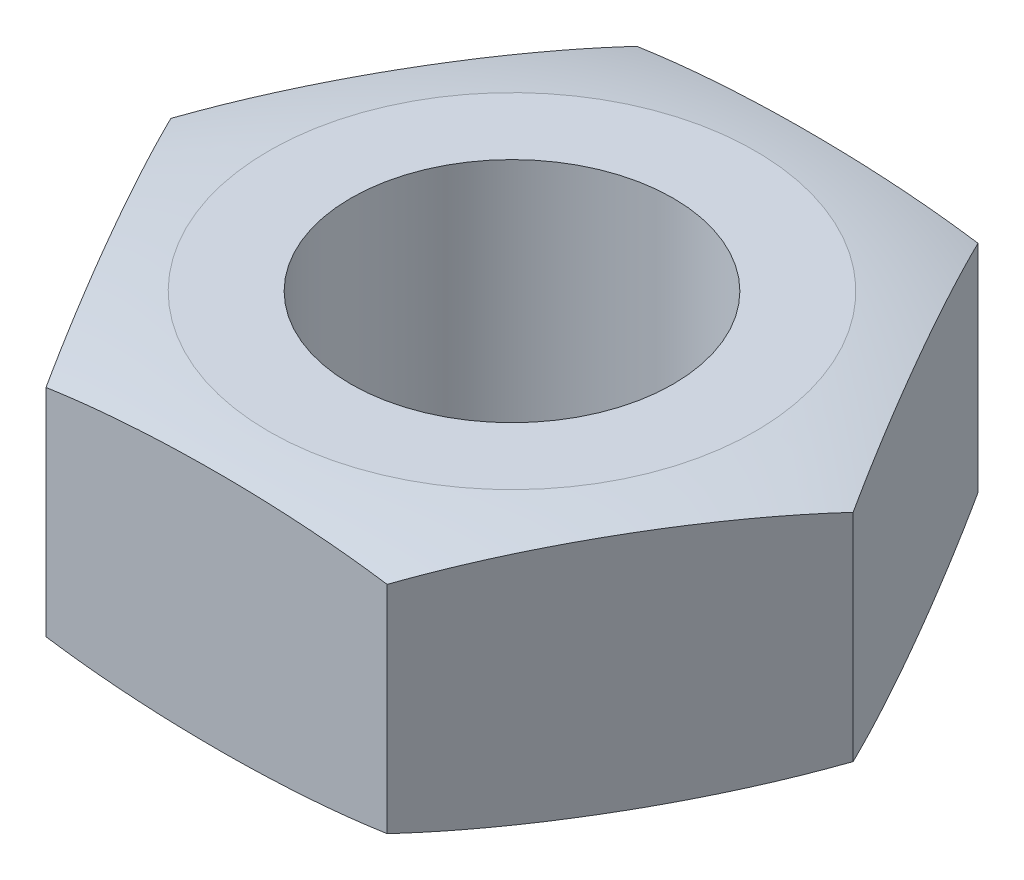
ISO-10303-21;
HEADER;
FILE_DESCRIPTION(('STEP AP214'),'2;1');
FILE_NAME('part.step','',(''),(''),'','','');
FILE_SCHEMA(('AUTOMOTIVE_DESIGN { 1 0 10303 214 1 1 1 1 }'));
ENDSEC;
DATA;
#1=APPLICATION_CONTEXT('core data for automotive mechanical design processes');
#2=APPLICATION_PROTOCOL_DEFINITION('international standard','automotive_design',2000,#1);
#3=PRODUCT_CONTEXT('',#1,'mechanical');
#4=PRODUCT('Part','Part','',(#3));
#5=PRODUCT_RELATED_PRODUCT_CATEGORY('part','',(#4));
#6=PRODUCT_DEFINITION_FORMATION('','',#4);
#7=PRODUCT_DEFINITION_CONTEXT('part definition',#1,'design');
#8=PRODUCT_DEFINITION('design','',#6,#7);
#9=PRODUCT_DEFINITION_SHAPE('','',#8);
#10=(LENGTH_UNIT() NAMED_UNIT(*) SI_UNIT(.MILLI.,.METRE.));
#11=(NAMED_UNIT(*) PLANE_ANGLE_UNIT() SI_UNIT($,.RADIAN.));
#12=(NAMED_UNIT(*) SI_UNIT($,.STERADIAN.) SOLID_ANGLE_UNIT());
#13=UNCERTAINTY_MEASURE_WITH_UNIT(LENGTH_MEASURE(1.E-05),#10,'distance_accuracy_value','');
#14=(GEOMETRIC_REPRESENTATION_CONTEXT(3) GLOBAL_UNCERTAINTY_ASSIGNED_CONTEXT((#13)) GLOBAL_UNIT_ASSIGNED_CONTEXT((#10,
#11,#12)) REPRESENTATION_CONTEXT('',''));
#15=CARTESIAN_POINT('',(0.,0.,0.));
#16=DIRECTION('',(0.,0.,1.));
#17=DIRECTION('',(1.,0.,0.));
#18=AXIS2_PLACEMENT_3D('',#15,#16,#17);
#19=CARTESIAN_POINT('',(0.,2.4,0.));
#20=DIRECTION('',(0.,1.,0.));
#21=DIRECTION('',(0.,0.,1.));
#22=AXIS2_PLACEMENT_3D('',#19,#20,#21);
#23=PLANE('',#22);
#24=CARTESIAN_POINT('',(0.,2.4,0.));
#25=DIRECTION('',(0.,1.,0.));
#26=DIRECTION('',(0.,0.,1.));
#27=AXIS2_PLACEMENT_3D('',#24,#25,#26);
#28=CIRCLE('',#27,1.5);
#29=CARTESIAN_POINT('',(0.,2.4,1.5));
#30=VERTEX_POINT('',#29);
#31=EDGE_CURVE('E113',#30,#30,#28,.T.);
#32=ORIENTED_EDGE('',*,*,#31,.F.);
#33=EDGE_LOOP('',(#32));
#34=FACE_BOUND('',#33,.T.);
#35=CARTESIAN_POINT('',(0.,2.4,0.));
#36=DIRECTION('',(0.,1.,0.));
#37=DIRECTION('',(0.,0.,1.));
#38=AXIS2_PLACEMENT_3D('',#35,#36,#37);
#39=CIRCLE('',#38,2.26306020734449);
#40=CARTESIAN_POINT('',(0.,2.4,2.26306020734449));
#41=VERTEX_POINT('',#40);
#42=EDGE_CURVE('E201',#41,#41,#39,.F.);
#43=ORIENTED_EDGE('',*,*,#42,.F.);
#44=EDGE_LOOP('',(#43));
#45=FACE_BOUND('',#44,.T.);
#46=ADVANCED_FACE('F33',(#34,#45),#23,.T.);
#47=CARTESIAN_POINT('',(0.,0.,0.));
#48=DIRECTION('',(0.,1.,0.));
#49=DIRECTION('',(0.,0.,1.));
#50=AXIS2_PLACEMENT_3D('',#47,#48,#49);
#51=PLANE('',#50);
#52=CARTESIAN_POINT('',(0.,0.,0.));
#53=DIRECTION('',(0.,1.,0.));
#54=DIRECTION('',(0.,0.,1.));
#55=AXIS2_PLACEMENT_3D('',#52,#53,#54);
#56=CIRCLE('',#55,1.5);
#57=CARTESIAN_POINT('',(0.,0.,1.5));
#58=VERTEX_POINT('',#57);
#59=EDGE_CURVE('E204',#58,#58,#56,.T.);
#60=ORIENTED_EDGE('',*,*,#59,.T.);
#61=EDGE_LOOP('',(#60));
#62=FACE_BOUND('',#61,.T.);
#63=CARTESIAN_POINT('',(0.,0.,0.));
#64=DIRECTION('',(0.,1.,0.));
#65=DIRECTION('',(0.,0.,1.));
#66=AXIS2_PLACEMENT_3D('',#63,#64,#65);
#67=CIRCLE('',#66,2.2630602073445);
#68=CARTESIAN_POINT('',(0.,0.,2.2630602073445));
#69=VERTEX_POINT('',#68);
#70=EDGE_CURVE('E236',#69,#69,#67,.T.);
#71=ORIENTED_EDGE('',*,*,#70,.F.);
#72=EDGE_LOOP('',(#71));
#73=FACE_BOUND('',#72,.T.);
#74=ADVANCED_FACE('F209',(#62,#73),#51,.F.);
#75=CARTESIAN_POINT('',(0.,2.4,0.));
#76=DIRECTION('',(0.,-1.,0.));
#77=DIRECTION('',(0.,0.,-1.));
#78=AXIS2_PLACEMENT_3D('',#75,#76,#77);
#79=CYLINDRICAL_SURFACE('',#78,1.5);
#80=ORIENTED_EDGE('',*,*,#31,.T.);
#81=EDGE_LOOP('',(#80));
#82=FACE_BOUND('',#81,.T.);
#83=ORIENTED_EDGE('',*,*,#59,.F.);
#84=EDGE_LOOP('',(#83));
#85=FACE_BOUND('',#84,.T.);
#86=ADVANCED_FACE('F135',(#82,#85),#79,.F.);
#87=CARTESIAN_POINT('',(0.,5.79760880032627,0.));
#88=DIRECTION('',(0.,-1.,0.));
#89=DIRECTION('',(0.,0.,-1.));
#90=AXIS2_PLACEMENT_3D('',#87,#88,#89);
#91=DEGENERATE_TOROIDAL_SURFACE('',#90,1.5,5.84760880032627,.T.);
#92=CARTESIAN_POINT('',(3.17554195059678,0.195190765911309,-0.000199999999999884));
#93=CARTESIAN_POINT('',(3.10970637660242,0.175507404125676,0.113830559103688));
#94=CARTESIAN_POINT('',(3.04365990153023,0.15884806046564,0.228226409589562));
#95=CARTESIAN_POINT('',(2.91130605269814,0.130963797625645,0.45747000034403));
#96=CARTESIAN_POINT('',(2.8449987974945,0.119736644783678,0.572317535267184));
#97=CARTESIAN_POINT('',(2.71254384273543,0.102129704822879,0.801736246624119));
#98=CARTESIAN_POINT('',(2.6463968716881,0.0957272436795646,0.916306161244891));
#99=CARTESIAN_POINT('',(2.51402322857986,0.0872438740575399,1.14558403669136));
#100=CARTESIAN_POINT('',(2.44779654449354,0.0851637299760271,1.26029201834568));
#101=CARTESIAN_POINT('',(2.31534317632091,0.0851637299760267,1.48970798165431));
#102=CARTESIAN_POINT('',(2.24911649223459,0.087243874057539,1.60441596330862));
#103=CARTESIAN_POINT('',(2.11674284912635,0.0957272436795638,1.83369383875509));
#104=CARTESIAN_POINT('',(2.05059587807901,0.102129704822878,1.94826375337586));
#105=CARTESIAN_POINT('',(1.91814092331995,0.119736644783678,2.1776824647328));
#106=CARTESIAN_POINT('',(1.8518336681163,0.130963797625645,2.29252999965595));
#107=CARTESIAN_POINT('',(1.71947981928422,0.15884806046564,2.52177359041042));
#108=CARTESIAN_POINT('',(1.65343334421202,0.175507404125675,2.63616944089629));
#109=CARTESIAN_POINT('',(1.58759777021767,0.195190765911309,2.75019999999998));
#110=B_SPLINE_CURVE_WITH_KNOTS('',3,(#92,#93,#94,#95,#96,#97,#98,#99,#100,#101,#102,#103,#104,
#105,#106,#107,#108,#109),.UNSPECIFIED.,.F.,.F.,(4,2,2,2,2,2,2,2,4),(0.,0.399324257481253,
0.798484177023077,1.19575630852369,1.59309869120282,1.99044107388195,2.38771320538256,
2.78687312492438,3.18619738240563),.UNSPECIFIED.);
#111=CARTESIAN_POINT('',(3.17542648054294,0.195156231142955,0.));
#112=VERTEX_POINT('',#111);
#113=CARTESIAN_POINT('',(1.5877132402715,0.195156231142954,2.74999999999998));
#114=VERTEX_POINT('',#113);
#115=EDGE_CURVE('E62',#112,#114,#110,.T.);
#116=ORIENTED_EDGE('',*,*,#115,.T.);
#117=CARTESIAN_POINT('',(4.77773028105844,1.54399340725614,2.74999999999995));
#118=CARTESIAN_POINT('',(4.64713600113223,1.43717665174646,2.74999999999995));
#119=CARTESIAN_POINT('',(4.51180855767463,1.3362058234138,2.74999999999995));
#120=CARTESIAN_POINT('',(4.23304689911178,1.14640695599499,2.74999999999995));
#121=CARTESIAN_POINT('',(4.0896194319695,1.05756901417398,2.74999999999996));
#122=CARTESIAN_POINT('',(3.79824313973091,0.893685076370557,2.74999999999996));
#123=CARTESIAN_POINT('',(3.65040925299496,0.818434193080734,2.74999999999996));
#124=CARTESIAN_POINT('',(3.34918302325373,0.679982896567805,2.74999999999996));
#125=CARTESIAN_POINT('',(3.195789339152,0.61678541411599,2.74999999999997));
#126=CARTESIAN_POINT('',(2.83622031111343,0.484460915433417,2.74999999999997));
#127=CARTESIAN_POINT('',(2.6284675425263,0.4196033409182,2.74999999999997));
#128=CARTESIAN_POINT('',(2.20794504812949,0.309097272031445,2.74999999999998));
#129=CARTESIAN_POINT('',(1.99517395472464,0.263454079363231,2.74999999999998));
#130=CARTESIAN_POINT('',(1.56500325529593,0.188896022187078,2.74999999999998));
#131=CARTESIAN_POINT('',(1.34758003135557,0.160120953780981,2.74999999999999));
#132=CARTESIAN_POINT('',(0.911332395632242,0.116956165648469,2.74999999999999));
#133=CARTESIAN_POINT('',(0.692507767802179,0.102568720467057,2.74999999999999));
#134=CARTESIAN_POINT('',(0.357453480795598,0.0897182304368472,2.75));
#135=CARTESIAN_POINT('',(0.241362795029605,0.0869484334347612,2.75));
#136=CARTESIAN_POINT('',(0.00914483388629153,0.0846282233381106,2.75));
#137=CARTESIAN_POINT('',(-0.106982441676806,0.0850778268615775,2.75));
#138=CARTESIAN_POINT('',(-0.33919172652221,0.0892181966378628,2.75));
#139=CARTESIAN_POINT('',(-0.455273730576654,0.0929092649793906,2.75));
#140=CARTESIAN_POINT('',(-0.687273676824347,0.103745972295698,2.75000000000001));
#141=CARTESIAN_POINT('',(-0.803191617440845,0.110891644248264,2.75000000000001));
#142=CARTESIAN_POINT('',(-1.14960598378012,0.137951316529396,2.75000000000001));
#143=CARTESIAN_POINT('',(-1.37970781732447,0.163499873610182,2.75000000000001));
#144=CARTESIAN_POINT('',(-1.837070239563,0.233046815279585,2.75000000000002));
#145=CARTESIAN_POINT('',(-2.06433245690889,0.277034072193646,2.75000000000002));
#146=CARTESIAN_POINT('',(-2.45989983220848,0.373231309052319,2.75000000000003));
#147=CARTESIAN_POINT('',(-2.62929467119488,0.42095192889325,2.75000000000003));
#148=CARTESIAN_POINT('',(-2.96381500587482,0.529502867779865,2.75000000000003));
#149=CARTESIAN_POINT('',(-3.12894165183637,0.59032961261675,2.75000000000003));
#150=CARTESIAN_POINT('',(-3.45329966799621,0.725391333504965,2.75000000000004));
#151=CARTESIAN_POINT('',(-3.61254067949747,0.799603093164125,2.75000000000004));
#152=CARTESIAN_POINT('',(-3.92393692934538,0.961516191335974,2.75000000000004));
#153=CARTESIAN_POINT('',(-4.07609608011628,1.04920996355412,2.75000000000004));
#154=CARTESIAN_POINT('',(-4.32012087928572,1.20477091294482,2.75000000000004));
#155=CARTESIAN_POINT('',(-4.41443732278513,1.26882373352528,2.75000000000005));
#156=CARTESIAN_POINT('',(-4.59912718570446,1.402364552311,2.75000000000005));
#157=CARTESIAN_POINT('',(-4.68950093743444,1.47185209106658,2.75000000000005));
#158=CARTESIAN_POINT('',(-4.77773028105838,1.54399340725614,2.75000000000005));
#159=B_SPLINE_CURVE_WITH_KNOTS('',3,(#117,#118,#119,#120,#121,#122,#123,#124,#125,#126,#127,
#128,#129,#130,#131,#132,#133,#134,#135,#136,#137,#138,#139,#140,#141,#142,#143,#144,#145,#146,
#147,#148,#149,#150,#151,#152,#153,#154,#155,#156,#157,#158),.UNSPECIFIED.,.F.,.F.,(4,2,2,2,2,2,
2,2,2,2,2,2,2,2,2,2,2,2,2,2,4),(0.,0.505924497310359,1.01143356456988,1.50853153800901,
2.00575022661724,2.6576188675461,3.30966725677581,3.96704583023985,4.62452831251903,
4.97286495544437,5.32120339642914,5.66957430430292,6.01794853780518,6.71186706992845,
7.40536742680102,7.93284790221685,8.4601847085846,8.98661549148125,9.51275190531162,
9.8545991443603,10.1964175149048),.UNSPECIFIED.);
#160=CARTESIAN_POINT('',(-1.58771324026132,0.19515623114144,2.75000000000002));
#161=VERTEX_POINT('',#160);
#162=EDGE_CURVE('E48',#114,#161,#159,.T.);
#163=ORIENTED_EDGE('',*,*,#162,.T.);
#164=CARTESIAN_POINT('',(-1.58759777021761,0.19519076591131,2.75020000000002));
#165=CARTESIAN_POINT('',(-1.65343334421197,0.175507404125676,2.63616944089633));
#166=CARTESIAN_POINT('',(-1.71947981928416,0.15884806046564,2.52177359041045));
#167=CARTESIAN_POINT('',(-1.85183366811626,0.130963797625643,2.29252999965598));
#168=CARTESIAN_POINT('',(-1.9181409233199,0.119736644783676,2.17768246473283));
#169=CARTESIAN_POINT('',(-2.05059587807897,0.102129704822876,1.94826375337589));
#170=CARTESIAN_POINT('',(-2.11674284912631,0.0957272436795614,1.83369383875512));
#171=CARTESIAN_POINT('',(-2.24911649223455,0.0872438740575367,1.60441596330865));
#172=CARTESIAN_POINT('',(-2.31534317632087,0.0851637299760244,1.48970798165434));
#173=CARTESIAN_POINT('',(-2.44779654449351,0.0851637299760249,1.2602920183457));
#174=CARTESIAN_POINT('',(-2.51402322857983,0.0872438740575376,1.14558403669139));
#175=CARTESIAN_POINT('',(-2.64639687168808,0.0957272436795621,0.916306161244917));
#176=CARTESIAN_POINT('',(-2.71254384273542,0.102129704822876,0.801736246624144));
#177=CARTESIAN_POINT('',(-2.84499879749448,0.119736644783676,0.572317535267209));
#178=CARTESIAN_POINT('',(-2.91130605269813,0.130963797625642,0.457470000344055));
#179=CARTESIAN_POINT('',(-3.04365990153023,0.158848060465639,0.228226409589585));
#180=CARTESIAN_POINT('',(-3.10970637660242,0.175507404125675,0.113830559103711));
#181=CARTESIAN_POINT('',(-3.17554195059678,0.195190765911309,-0.000199999999977638));
#182=B_SPLINE_CURVE_WITH_KNOTS('',3,(#164,#165,#166,#167,#168,#169,#170,#171,#172,#173,#174,
#175,#176,#177,#178,#179,#180,#181),.UNSPECIFIED.,.F.,.F.,(4,2,2,2,2,2,2,2,4),(0.,
0.399324257481259,0.798484177023086,1.1957563085237,1.59309869120284,1.99044107388197,
2.38771320538259,2.78687312492441,3.18619738240567),.UNSPECIFIED.);
#183=CARTESIAN_POINT('',(-3.17542648054294,0.195156231142955,0.));
#184=VERTEX_POINT('',#183);
#185=EDGE_CURVE('E92',#161,#184,#182,.T.);
#186=ORIENTED_EDGE('',*,*,#185,.T.);
#187=CARTESIAN_POINT('',(-3.17554195059678,0.19519076591131,0.000200000000022174));
#188=CARTESIAN_POINT('',(-3.10970637660242,0.175507404125676,-0.113830559103667));
#189=CARTESIAN_POINT('',(-3.04365990153023,0.15884806046564,-0.228226409589542));
#190=CARTESIAN_POINT('',(-2.91130605269814,0.130963797625643,-0.457470000344013));
#191=CARTESIAN_POINT('',(-2.84499879749449,0.119736644783676,-0.572317535267168));
#192=CARTESIAN_POINT('',(-2.71254384273543,0.102129704822876,-0.801736246624106));
#193=CARTESIAN_POINT('',(-2.64639687168809,0.0957272436795622,-0.91630616124488));
#194=CARTESIAN_POINT('',(-2.51402322857985,0.0872438740575376,-1.14558403669135));
#195=CARTESIAN_POINT('',(-2.44779654449353,0.0851637299760245,-1.26029201834567));
#196=CARTESIAN_POINT('',(-2.3153431763209,0.0851637299760245,-1.4897079816543));
#197=CARTESIAN_POINT('',(-2.24911649223458,0.0872438740575375,-1.60441596330862));
#198=CARTESIAN_POINT('',(-2.11674284912633,0.0957272436795621,-1.83369383875509));
#199=CARTESIAN_POINT('',(-2.050595878079,0.102129704822876,-1.94826375337587));
#200=CARTESIAN_POINT('',(-1.91814092331994,0.119736644783676,-2.1776824647328));
#201=CARTESIAN_POINT('',(-1.85183366811629,0.130963797625643,-2.29252999965596));
#202=CARTESIAN_POINT('',(-1.7194798192842,0.15884806046564,-2.52177359041043));
#203=CARTESIAN_POINT('',(-1.653433344212,0.175507404125676,-2.6361694408963));
#204=CARTESIAN_POINT('',(-1.58759777021765,0.195190765911309,-2.75019999999999));
#205=B_SPLINE_CURVE_WITH_KNOTS('',3,(#187,#188,#189,#190,#191,#192,#193,#194,#195,#196,#197,
#198,#199,#200,#201,#202,#203,#204),.UNSPECIFIED.,.F.,.F.,(4,2,2,2,2,2,2,2,4),(0.,
0.399324257481258,0.798484177023086,1.1957563085237,1.59309869120284,1.99044107388197,
2.38771320538258,2.78687312492441,3.18619738240567),.UNSPECIFIED.);
#206=CARTESIAN_POINT('',(-1.58771324027148,0.195156231142956,-2.74999999999999));
#207=VERTEX_POINT('',#206);
#208=EDGE_CURVE('E106',#184,#207,#205,.T.);
#209=ORIENTED_EDGE('',*,*,#208,.T.);
#210=CARTESIAN_POINT('',(-4.77773028105842,1.54399340725614,-2.74999999999998));
#211=CARTESIAN_POINT('',(-4.64713600113221,1.43717665174646,-2.74999999999998));
#212=CARTESIAN_POINT('',(-4.51180855767461,1.3362058234138,-2.74999999999998));
#213=CARTESIAN_POINT('',(-4.23304689911176,1.14640695599499,-2.74999999999998));
#214=CARTESIAN_POINT('',(-4.08961943196948,1.05756901417398,-2.74999999999998));
#215=CARTESIAN_POINT('',(-3.79824313973089,0.893685076370556,-2.74999999999999));
#216=CARTESIAN_POINT('',(-3.65040925299494,0.818434193080734,-2.74999999999999));
#217=CARTESIAN_POINT('',(-3.34918302325371,0.679982896567805,-2.74999999999999));
#218=CARTESIAN_POINT('',(-3.19578933915198,0.61678541411599,-2.74999999999999));
#219=CARTESIAN_POINT('',(-2.83622031111341,0.484460915433416,-2.74999999999999));
#220=CARTESIAN_POINT('',(-2.62846754252628,0.4196033409182,-2.74999999999999));
#221=CARTESIAN_POINT('',(-2.20794504812947,0.309097272031444,-2.74999999999999));
#222=CARTESIAN_POINT('',(-1.99517395472462,0.263454079363229,-2.74999999999999));
#223=CARTESIAN_POINT('',(-1.56500325529591,0.188896022187077,-2.74999999999999));
#224=CARTESIAN_POINT('',(-1.34758003135555,0.160120953780981,-2.74999999999999));
#225=CARTESIAN_POINT('',(-0.911332395632221,0.116956165648469,-2.75));
#226=CARTESIAN_POINT('',(-0.692507767802157,0.102568720467057,-2.75));
#227=CARTESIAN_POINT('',(-0.357453480795576,0.0897182304368472,-2.75));
#228=CARTESIAN_POINT('',(-0.241362795029583,0.0869484334347614,-2.75));
#229=CARTESIAN_POINT('',(-0.00914483388626991,0.0846282233381106,-2.75));
#230=CARTESIAN_POINT('',(0.106982441676828,0.0850778268615772,-2.75));
#231=CARTESIAN_POINT('',(0.339191726522232,0.0892181966378628,-2.75));
#232=CARTESIAN_POINT('',(0.455273730576676,0.0929092649793913,-2.75));
#233=CARTESIAN_POINT('',(0.687273676824369,0.103745972295699,-2.75));
#234=CARTESIAN_POINT('',(0.803191617440866,0.110891644248264,-2.75));
#235=CARTESIAN_POINT('',(1.14960598378014,0.137951316529395,-2.75));
#236=CARTESIAN_POINT('',(1.37970781732449,0.163499873610183,-2.75));
#237=CARTESIAN_POINT('',(1.83707023956302,0.233046815279586,-2.75000000000001));
#238=CARTESIAN_POINT('',(2.06433245690891,0.277034072193648,-2.75000000000001));
#239=CARTESIAN_POINT('',(2.4598998322085,0.373231309052319,-2.75000000000001));
#240=CARTESIAN_POINT('',(2.6292946711949,0.42095192889325,-2.75000000000001));
#241=CARTESIAN_POINT('',(2.96381500587484,0.529502867779866,-2.75000000000001));
#242=CARTESIAN_POINT('',(3.12894165183639,0.590329612616751,-2.75000000000001));
#243=CARTESIAN_POINT('',(3.45329966799623,0.725391333504967,-2.75000000000001));
#244=CARTESIAN_POINT('',(3.61254067949749,0.799603093164126,-2.75000000000001));
#245=CARTESIAN_POINT('',(3.92393692934541,0.961516191335975,-2.75000000000001));
#246=CARTESIAN_POINT('',(4.07609608011631,1.04920996355412,-2.75000000000001));
#247=CARTESIAN_POINT('',(4.32012087928574,1.20477091294482,-2.75000000000002));
#248=CARTESIAN_POINT('',(4.41443732278515,1.26882373352528,-2.75000000000002));
#249=CARTESIAN_POINT('',(4.59912718570448,1.402364552311,-2.75000000000002));
#250=CARTESIAN_POINT('',(4.68950093743446,1.47185209106658,-2.75000000000002));
#251=CARTESIAN_POINT('',(4.7777302810584,1.54399340725614,-2.75000000000002));
#252=B_SPLINE_CURVE_WITH_KNOTS('',3,(#210,#211,#212,#213,#214,#215,#216,#217,#218,#219,#220,
#221,#222,#223,#224,#225,#226,#227,#228,#229,#230,#231,#232,#233,#234,#235,#236,#237,#238,#239,
#240,#241,#242,#243,#244,#245,#246,#247,#248,#249,#250,#251),.UNSPECIFIED.,.F.,.F.,(4,2,2,2,2,2,
2,2,2,2,2,2,2,2,2,2,2,2,2,2,4),(0.,0.505924497310359,1.01143356456988,1.50853153800901,
2.00575022661724,2.6576188675461,3.30966725677581,3.96704583023985,4.62452831251903,
4.97286495544437,5.32120339642914,5.66957430430292,6.01794853780518,6.71186706992845,
7.40536742680102,7.93284790221684,8.4601847085846,8.98661549148125,9.51275190531162,
9.8545991443603,10.1964175149048),.UNSPECIFIED.);
#253=CARTESIAN_POINT('',(1.58771324026134,0.195156231141441,-2.75000000000001));
#254=VERTEX_POINT('',#253);
#255=EDGE_CURVE('E155',#207,#254,#252,.T.);
#256=ORIENTED_EDGE('',*,*,#255,.T.);
#257=CARTESIAN_POINT('',(1.58759777021763,0.19519076591131,-2.75020000000001));
#258=CARTESIAN_POINT('',(1.65343334421199,0.175507404125676,-2.63616944089632));
#259=CARTESIAN_POINT('',(1.71947981928418,0.15884806046564,-2.52177359041044));
#260=CARTESIAN_POINT('',(1.85183366811627,0.130963797625643,-2.29252999965597));
#261=CARTESIAN_POINT('',(1.91814092331992,0.119736644783676,-2.17768246473282));
#262=CARTESIAN_POINT('',(2.05059587807899,0.102129704822876,-1.94826375337588));
#263=CARTESIAN_POINT('',(2.11674284912632,0.0957272436795619,-1.83369383875511));
#264=CARTESIAN_POINT('',(2.24911649223457,0.0872438740575368,-1.60441596330864));
#265=CARTESIAN_POINT('',(2.31534317632089,0.0851637299760237,-1.48970798165432));
#266=CARTESIAN_POINT('',(2.44779654449352,0.0851637299760237,-1.26029201834569));
#267=CARTESIAN_POINT('',(2.51402322857984,0.0872438740575368,-1.14558403669137));
#268=CARTESIAN_POINT('',(2.64639687168809,0.095727243679562,-0.916306161244899));
#269=CARTESIAN_POINT('',(2.71254384273542,0.102129704822876,-0.801736246624125));
#270=CARTESIAN_POINT('',(2.84499879749449,0.119736644783676,-0.572317535267188));
#271=CARTESIAN_POINT('',(2.91130605269814,0.130963797625643,-0.457470000344034));
#272=CARTESIAN_POINT('',(3.04365990153023,0.15884806046564,-0.228226409589563));
#273=CARTESIAN_POINT('',(3.10970637660242,0.175507404125676,-0.113830559103689));
#274=CARTESIAN_POINT('',(3.17554195059678,0.19519076591131,0.000200000000000036));
#275=B_SPLINE_CURVE_WITH_KNOTS('',3,(#257,#258,#259,#260,#261,#262,#263,#264,#265,#266,#267,
#268,#269,#270,#271,#272,#273,#274),.UNSPECIFIED.,.F.,.F.,(4,2,2,2,2,2,2,2,4),(0.,
0.399324257481259,0.798484177023087,1.1957563085237,1.59309869120284,1.99044107388197,
2.38771320538259,2.78687312492441,3.18619738240567),.UNSPECIFIED.);
#276=EDGE_CURVE('E162',#254,#112,#275,.T.);
#277=ORIENTED_EDGE('',*,*,#276,.T.);
#278=EDGE_LOOP('',(#116,#163,#186,#209,#256,#277));
#279=FACE_BOUND('',#278,.T.);
#280=ORIENTED_EDGE('',*,*,#70,.T.);
#281=EDGE_LOOP('',(#280));
#282=FACE_BOUND('',#281,.T.);
#283=ADVANCED_FACE('F90',(#279,#282),#91,.T.);
#284=CARTESIAN_POINT('',(0.,-3.39760880032616,0.));
#285=DIRECTION('',(0.,-1.,0.));
#286=DIRECTION('',(0.,0.,-1.));
#287=AXIS2_PLACEMENT_3D('',#284,#285,#286);
#288=DEGENERATE_TOROIDAL_SURFACE('',#287,1.5,5.84760880032616,.T.);
#289=ORIENTED_EDGE('',*,*,#42,.T.);
#290=EDGE_LOOP('',(#289));
#291=FACE_BOUND('',#290,.T.);
#292=CARTESIAN_POINT('',(1.58759777021763,2.20480923408869,-2.75020000000001));
#293=CARTESIAN_POINT('',(1.65343334421199,2.22449259587432,-2.63616944089632));
#294=CARTESIAN_POINT('',(1.71947981928418,2.24115193953436,-2.52177359041044));
#295=CARTESIAN_POINT('',(1.85183366811627,2.26903620237435,-2.29252999965597));
#296=CARTESIAN_POINT('',(1.91814092331992,2.28026335521632,-2.17768246473282));
#297=CARTESIAN_POINT('',(2.05059587807899,2.29787029517712,-1.94826375337588));
#298=CARTESIAN_POINT('',(2.11674284912632,2.30427275632043,-1.83369383875511));
#299=CARTESIAN_POINT('',(2.24911649223457,2.31275612594246,-1.60441596330864));
#300=CARTESIAN_POINT('',(2.31534317632089,2.31483627002397,-1.48970798165432));
#301=CARTESIAN_POINT('',(2.44779654449352,2.31483627002397,-1.26029201834568));
#302=CARTESIAN_POINT('',(2.51402322857984,2.31275612594246,-1.14558403669137));
#303=CARTESIAN_POINT('',(2.64639687168809,2.30427275632043,-0.916306161244898));
#304=CARTESIAN_POINT('',(2.71254384273542,2.29787029517712,-0.801736246624124));
#305=CARTESIAN_POINT('',(2.84499879749449,2.28026335521632,-0.572317535267187));
#306=CARTESIAN_POINT('',(2.91130605269814,2.26903620237435,-0.457470000344033));
#307=CARTESIAN_POINT('',(3.04365990153023,2.24115193953436,-0.228226409589563));
#308=CARTESIAN_POINT('',(3.10970637660242,2.22449259587432,-0.113830559103689));
#309=CARTESIAN_POINT('',(3.17554195059678,2.20480923408868,0.000200000000000693));
#310=B_SPLINE_CURVE_WITH_KNOTS('',3,(#292,#293,#294,#295,#296,#297,#298,#299,#300,#301,#302,
#303,#304,#305,#306,#307,#308,#309),.UNSPECIFIED.,.F.,.F.,(4,2,2,2,2,2,2,2,4),(0.,
0.399324257481259,0.798484177023087,1.1957563085237,1.59309869120284,1.99044107388197,
2.38771320538259,2.78687312492442,3.18619738240567),.UNSPECIFIED.);
#311=CARTESIAN_POINT('',(1.58771324026133,2.20484376885855,-2.75000000000001));
#312=VERTEX_POINT('',#311);
#313=CARTESIAN_POINT('',(3.17542648054294,2.20484376885704,0.));
#314=VERTEX_POINT('',#313);
#315=EDGE_CURVE('E180',#312,#314,#310,.T.);
#316=ORIENTED_EDGE('',*,*,#315,.F.);
#317=CARTESIAN_POINT('',(-4.77773028105842,0.856006592743822,-2.74999999999998));
#318=CARTESIAN_POINT('',(-4.64713600113221,0.962823348253505,-2.74999999999998));
#319=CARTESIAN_POINT('',(-4.51180855767462,1.06379417658617,-2.74999999999998));
#320=CARTESIAN_POINT('',(-4.23304689911178,1.25359304400498,-2.74999999999998));
#321=CARTESIAN_POINT('',(-4.0896194319695,1.34243098582598,-2.74999999999998));
#322=CARTESIAN_POINT('',(-3.79824313973092,1.50631492362941,-2.74999999999999));
#323=CARTESIAN_POINT('',(-3.65040925299498,1.58156580691923,-2.74999999999999));
#324=CARTESIAN_POINT('',(-3.34918302325375,1.72001710343216,-2.74999999999999));
#325=CARTESIAN_POINT('',(-3.19578933915203,1.78321458588398,-2.74999999999999));
#326=CARTESIAN_POINT('',(-2.83622031111347,1.91553908456655,-2.74999999999999));
#327=CARTESIAN_POINT('',(-2.62846754252635,1.98039665908177,-2.74999999999999));
#328=CARTESIAN_POINT('',(-2.20794504812956,2.09090272796853,-2.74999999999999));
#329=CARTESIAN_POINT('',(-1.99517395472472,2.13654592063675,-2.74999999999999));
#330=CARTESIAN_POINT('',(-1.56500325529602,2.2111039778129,-2.74999999999999));
#331=CARTESIAN_POINT('',(-1.34758003135567,2.239879046219,-2.74999999999999));
#332=CARTESIAN_POINT('',(-0.911332395632356,2.28304383435152,-2.75));
#333=CARTESIAN_POINT('',(-0.692507767802301,2.29743127953293,-2.75));
#334=CARTESIAN_POINT('',(-0.357453480795734,2.31028176956315,-2.75));
#335=CARTESIAN_POINT('',(-0.241362795029746,2.31305156656523,-2.75));
#336=CARTESIAN_POINT('',(-0.00914483388644275,2.31537177666189,-2.75));
#337=CARTESIAN_POINT('',(0.10698244167665,2.31492217313842,-2.75));
#338=CARTESIAN_POINT('',(0.339191726522044,2.31078180336214,-2.75));
#339=CARTESIAN_POINT('',(0.455273730576483,2.30709073502061,-2.75));
#340=CARTESIAN_POINT('',(0.687273676824166,2.29625402770431,-2.75));
#341=CARTESIAN_POINT('',(0.803191617440658,2.28910835575175,-2.75));
#342=CARTESIAN_POINT('',(1.14960598377992,2.26204868347062,-2.75));
#343=CARTESIAN_POINT('',(1.37970781732426,2.23650012638984,-2.75));
#344=CARTESIAN_POINT('',(1.83707023956277,2.16695318472045,-2.75000000000001));
#345=CARTESIAN_POINT('',(2.06433245690865,2.1229659278064,-2.75000000000001));
#346=CARTESIAN_POINT('',(2.45989983220823,2.02676869094774,-2.75000000000001));
#347=CARTESIAN_POINT('',(2.62929467119463,1.97904807110682,-2.75000000000001));
#348=CARTESIAN_POINT('',(2.96381500587458,1.87049713222022,-2.75000000000001));
#349=CARTESIAN_POINT('',(3.12894165183613,1.80967038738334,-2.75000000000001));
#350=CARTESIAN_POINT('',(3.45329966799597,1.67460866649513,-2.75000000000001));
#351=CARTESIAN_POINT('',(3.61254067949723,1.60039690683598,-2.75000000000001));
#352=CARTESIAN_POINT('',(3.92393692934515,1.43848380866414,-2.75000000000001));
#353=CARTESIAN_POINT('',(4.07609608011605,1.350790036446,-2.75000000000001));
#354=CARTESIAN_POINT('',(4.32012087928553,1.19522908705529,-2.75000000000002));
#355=CARTESIAN_POINT('',(4.41443732278499,1.1311762664748,-2.75000000000002));
#356=CARTESIAN_POINT('',(4.5991271857044,0.997635447689029,-2.75000000000002));
#357=CARTESIAN_POINT('',(4.68950093743442,0.928147908933416,-2.75000000000002));
#358=CARTESIAN_POINT('',(4.7777302810584,0.856006592743821,-2.75000000000002));
#359=B_SPLINE_CURVE_WITH_KNOTS('',3,(#317,#318,#319,#320,#321,#322,#323,#324,#325,#326,#327,
#328,#329,#330,#331,#332,#333,#334,#335,#336,#337,#338,#339,#340,#341,#342,#343,#344,#345,#346,
#347,#348,#349,#350,#351,#352,#353,#354,#355,#356,#357,#358),.UNSPECIFIED.,.F.,.F.,(4,2,2,2,2,2,
2,2,2,2,2,2,2,2,2,2,2,2,2,2,4),(0.,0.505924497310349,1.01143356456985,1.50853153800898,
2.0057502266172,2.65761886754604,3.30966725677572,3.96704583023974,4.62452831251889,
4.97286495544422,5.32120339642898,5.66957430430274,6.01794853780499,6.71186706992822,
7.40536742680076,7.93284790221659,8.46018470858434,8.98661549148098,9.51275190531135,
9.85459914436018,10.1964175149048),.UNSPECIFIED.);
#360=CARTESIAN_POINT('',(-1.58771324027148,2.20484376885704,-2.74999999999999));
#361=VERTEX_POINT('',#360);
#362=EDGE_CURVE('E189',#361,#312,#359,.T.);
#363=ORIENTED_EDGE('',*,*,#362,.F.);
#364=CARTESIAN_POINT('',(-3.17554195059678,2.20480923408869,0.000200000000022174));
#365=CARTESIAN_POINT('',(-3.10970637660242,2.22449259587432,-0.113830559103668));
#366=CARTESIAN_POINT('',(-3.04365990153023,2.24115193953436,-0.228226409589542));
#367=CARTESIAN_POINT('',(-2.91130605269814,2.26903620237435,-0.457470000344013));
#368=CARTESIAN_POINT('',(-2.84499879749449,2.28026335521632,-0.572317535267168));
#369=CARTESIAN_POINT('',(-2.71254384273543,2.29787029517712,-0.801736246624106));
#370=CARTESIAN_POINT('',(-2.64639687168809,2.30427275632043,-0.91630616124488));
#371=CARTESIAN_POINT('',(-2.51402322857985,2.31275612594246,-1.14558403669135));
#372=CARTESIAN_POINT('',(-2.44779654449353,2.31483627002397,-1.26029201834567));
#373=CARTESIAN_POINT('',(-2.3153431763209,2.31483627002397,-1.4897079816543));
#374=CARTESIAN_POINT('',(-2.24911649223458,2.31275612594246,-1.60441596330862));
#375=CARTESIAN_POINT('',(-2.11674284912633,2.30427275632043,-1.83369383875509));
#376=CARTESIAN_POINT('',(-2.050595878079,2.29787029517712,-1.94826375337587));
#377=CARTESIAN_POINT('',(-1.91814092331994,2.28026335521632,-2.1776824647328));
#378=CARTESIAN_POINT('',(-1.85183366811629,2.26903620237435,-2.29252999965596));
#379=CARTESIAN_POINT('',(-1.7194798192842,2.24115193953436,-2.52177359041043));
#380=CARTESIAN_POINT('',(-1.653433344212,2.22449259587432,-2.6361694408963));
#381=CARTESIAN_POINT('',(-1.58759777021765,2.20480923408868,-2.75019999999999));
#382=B_SPLINE_CURVE_WITH_KNOTS('',3,(#364,#365,#366,#367,#368,#369,#370,#371,#372,#373,#374,
#375,#376,#377,#378,#379,#380,#381),.UNSPECIFIED.,.F.,.F.,(4,2,2,2,2,2,2,2,4),(0.,
0.399324257481258,0.798484177023087,1.1957563085237,1.59309869120284,1.99044107388197,
2.38771320538259,2.78687312492441,3.18619738240567),.UNSPECIFIED.);
#383=CARTESIAN_POINT('',(-3.17542648054294,2.20484376885704,0.));
#384=VERTEX_POINT('',#383);
#385=EDGE_CURVE('E233',#384,#361,#382,.T.);
#386=ORIENTED_EDGE('',*,*,#385,.F.);
#387=CARTESIAN_POINT('',(-1.58759777021761,2.20480923408868,2.75020000000002));
#388=CARTESIAN_POINT('',(-1.65343334421197,2.22449259587432,2.63616944089633));
#389=CARTESIAN_POINT('',(-1.71947981928416,2.24115193953436,2.52177359041045));
#390=CARTESIAN_POINT('',(-1.85183366811626,2.26903620237435,2.29252999965598));
#391=CARTESIAN_POINT('',(-1.91814092331991,2.28026335521632,2.17768246473283));
#392=CARTESIAN_POINT('',(-2.05059587807897,2.29787029517712,1.94826375337589));
#393=CARTESIAN_POINT('',(-2.11674284912631,2.30427275632043,1.83369383875512));
#394=CARTESIAN_POINT('',(-2.24911649223456,2.31275612594246,1.60441596330865));
#395=CARTESIAN_POINT('',(-2.31534317632088,2.31483627002397,1.48970798165434));
#396=CARTESIAN_POINT('',(-2.44779654449352,2.31483627002397,1.2602920183457));
#397=CARTESIAN_POINT('',(-2.51402322857983,2.31275612594246,1.14558403669138));
#398=CARTESIAN_POINT('',(-2.64639687168808,2.30427275632044,0.916306161244916));
#399=CARTESIAN_POINT('',(-2.71254384273542,2.29787029517712,0.801736246624143));
#400=CARTESIAN_POINT('',(-2.84499879749448,2.28026335521632,0.572317535267207));
#401=CARTESIAN_POINT('',(-2.91130605269813,2.26903620237435,0.457470000344053));
#402=CARTESIAN_POINT('',(-3.04365990153023,2.24115193953436,0.228226409589584));
#403=CARTESIAN_POINT('',(-3.10970637660242,2.22449259587432,0.11383055910371));
#404=CARTESIAN_POINT('',(-3.17554195059678,2.20480923408868,-0.000199999999978475));
#405=B_SPLINE_CURVE_WITH_KNOTS('',3,(#387,#388,#389,#390,#391,#392,#393,#394,#395,#396,#397,
#398,#399,#400,#401,#402,#403,#404),.UNSPECIFIED.,.F.,.F.,(4,2,2,2,2,2,2,2,4),(0.,
0.399324257481259,0.798484177023087,1.1957563085237,1.59309869120284,1.99044107388197,
2.38771320538259,2.78687312492441,3.18619738240567),.UNSPECIFIED.);
#406=CARTESIAN_POINT('',(-1.58771324027145,2.20484376885855,2.75000000000002));
#407=VERTEX_POINT('',#406);
#408=EDGE_CURVE('E55',#407,#384,#405,.T.);
#409=ORIENTED_EDGE('',*,*,#408,.F.);
#410=CARTESIAN_POINT('',(4.77773028105844,0.856006592743821,2.74999999999995));
#411=CARTESIAN_POINT('',(4.64713600113223,0.962823348253505,2.74999999999995));
#412=CARTESIAN_POINT('',(4.51180855767464,1.06379417658617,2.74999999999995));
#413=CARTESIAN_POINT('',(4.2330468991118,1.25359304400498,2.74999999999995));
#414=CARTESIAN_POINT('',(4.08961943196952,1.34243098582598,2.74999999999996));
#415=CARTESIAN_POINT('',(3.79824313973094,1.50631492362941,2.74999999999996));
#416=CARTESIAN_POINT('',(3.650409252995,1.58156580691923,2.74999999999996));
#417=CARTESIAN_POINT('',(3.34918302325377,1.72001710343216,2.74999999999996));
#418=CARTESIAN_POINT('',(3.19578933915205,1.78321458588398,2.74999999999997));
#419=CARTESIAN_POINT('',(2.83622031111349,1.91553908456655,2.74999999999997));
#420=CARTESIAN_POINT('',(2.62846754252637,1.98039665908177,2.74999999999997));
#421=CARTESIAN_POINT('',(2.20794504812958,2.09090272796853,2.74999999999998));
#422=CARTESIAN_POINT('',(1.99517395472474,2.13654592063674,2.74999999999998));
#423=CARTESIAN_POINT('',(1.56500325529604,2.2111039778129,2.74999999999998));
#424=CARTESIAN_POINT('',(1.34758003135569,2.239879046219,2.74999999999999));
#425=CARTESIAN_POINT('',(0.911332395632376,2.28304383435152,2.74999999999999));
#426=CARTESIAN_POINT('',(0.692507767802321,2.29743127953293,2.74999999999999));
#427=CARTESIAN_POINT('',(0.357453480795753,2.31028176956314,2.75));
#428=CARTESIAN_POINT('',(0.241362795029765,2.31305156656523,2.75));
#429=CARTESIAN_POINT('',(0.00914483388646208,2.31537177666189,2.75));
#430=CARTESIAN_POINT('',(-0.10698244167663,2.31492217313842,2.75));
#431=CARTESIAN_POINT('',(-0.339191726522024,2.31078180336214,2.75));
#432=CARTESIAN_POINT('',(-0.455273730576463,2.30709073502061,2.75));
#433=CARTESIAN_POINT('',(-0.687273676824146,2.29625402770431,2.75000000000001));
#434=CARTESIAN_POINT('',(-0.803191617440639,2.28910835575175,2.75000000000001));
#435=CARTESIAN_POINT('',(-1.1496059837799,2.26204868347062,2.75000000000001));
#436=CARTESIAN_POINT('',(-1.37970781732424,2.23650012638984,2.75000000000001));
#437=CARTESIAN_POINT('',(-1.83707023956275,2.16695318472045,2.75000000000002));
#438=CARTESIAN_POINT('',(-2.06433245690863,2.1229659278064,2.75000000000002));
#439=CARTESIAN_POINT('',(-2.45989983220821,2.02676869094774,2.75000000000003));
#440=CARTESIAN_POINT('',(-2.62929467119461,1.97904807110682,2.75000000000003));
#441=CARTESIAN_POINT('',(-2.96381500587456,1.87049713222022,2.75000000000003));
#442=CARTESIAN_POINT('',(-3.1289416518361,1.80967038738334,2.75000000000003));
#443=CARTESIAN_POINT('',(-3.45329966799595,1.67460866649513,2.75000000000004));
#444=CARTESIAN_POINT('',(-3.61254067949721,1.60039690683598,2.75000000000004));
#445=CARTESIAN_POINT('',(-3.92393692934513,1.43848380866415,2.75000000000004));
#446=CARTESIAN_POINT('',(-4.07609608011604,1.350790036446,2.75000000000004));
#447=CARTESIAN_POINT('',(-4.32012087928552,1.19522908705529,2.75000000000004));
#448=CARTESIAN_POINT('',(-4.41443732278497,1.1311762664748,2.75000000000005));
#449=CARTESIAN_POINT('',(-4.59912718570439,0.997635447689028,2.75000000000005));
#450=CARTESIAN_POINT('',(-4.6895009374344,0.928147908933416,2.75000000000005));
#451=CARTESIAN_POINT('',(-4.77773028105838,0.856006592743821,2.75000000000005));
#452=B_SPLINE_CURVE_WITH_KNOTS('',3,(#410,#411,#412,#413,#414,#415,#416,#417,#418,#419,#420,
#421,#422,#423,#424,#425,#426,#427,#428,#429,#430,#431,#432,#433,#434,#435,#436,#437,#438,#439,
#440,#441,#442,#443,#444,#445,#446,#447,#448,#449,#450,#451),.UNSPECIFIED.,.F.,.F.,(4,2,2,2,2,2,
2,2,2,2,2,2,2,2,2,2,2,2,2,2,4),(0.,0.505924497310349,1.01143356456985,1.50853153800898,
2.0057502266172,2.65761886754604,3.30966725677573,3.96704583023974,4.62452831251889,
4.97286495544422,5.32120339642897,5.66957430430274,6.01794853780499,6.71186706992822,
7.40536742680076,7.93284790221658,8.46018470858434,8.98661549148098,9.51275190531135,
9.85459914436018,10.1964175149048),.UNSPECIFIED.);
#453=CARTESIAN_POINT('',(1.5877132402715,2.20484376885704,2.74999999999998));
#454=VERTEX_POINT('',#453);
#455=EDGE_CURVE('E11',#454,#407,#452,.T.);
#456=ORIENTED_EDGE('',*,*,#455,.F.);
#457=CARTESIAN_POINT('',(3.17554195059678,2.20480923408869,-0.000199999999999884));
#458=CARTESIAN_POINT('',(3.10970637660242,2.22449259587432,0.113830559103688));
#459=CARTESIAN_POINT('',(3.04365990153023,2.24115193953436,0.228226409589562));
#460=CARTESIAN_POINT('',(2.91130605269814,2.26903620237435,0.45747000034403));
#461=CARTESIAN_POINT('',(2.8449987974945,2.28026335521632,0.572317535267184));
#462=CARTESIAN_POINT('',(2.71254384273543,2.29787029517712,0.801736246624119));
#463=CARTESIAN_POINT('',(2.6463968716881,2.30427275632043,0.916306161244891));
#464=CARTESIAN_POINT('',(2.51402322857986,2.31275612594246,1.14558403669136));
#465=CARTESIAN_POINT('',(2.44779654449354,2.31483627002397,1.26029201834568));
#466=CARTESIAN_POINT('',(2.31534317632091,2.31483627002397,1.48970798165431));
#467=CARTESIAN_POINT('',(2.24911649223459,2.31275612594246,1.60441596330862));
#468=CARTESIAN_POINT('',(2.11674284912635,2.30427275632043,1.83369383875509));
#469=CARTESIAN_POINT('',(2.05059587807901,2.29787029517712,1.94826375337586));
#470=CARTESIAN_POINT('',(1.91814092331995,2.28026335521632,2.1776824647328));
#471=CARTESIAN_POINT('',(1.8518336681163,2.26903620237435,2.29252999965595));
#472=CARTESIAN_POINT('',(1.71947981928422,2.24115193953435,2.52177359041042));
#473=CARTESIAN_POINT('',(1.65343334421202,2.22449259587432,2.63616944089629));
#474=CARTESIAN_POINT('',(1.58759777021767,2.20480923408869,2.75019999999998));
#475=B_SPLINE_CURVE_WITH_KNOTS('',3,(#457,#458,#459,#460,#461,#462,#463,#464,#465,#466,#467,
#468,#469,#470,#471,#472,#473,#474),.UNSPECIFIED.,.F.,.F.,(4,2,2,2,2,2,2,2,4),(0.,
0.399324257481253,0.798484177023077,1.19575630852369,1.59309869120282,1.99044107388195,
2.38771320538256,2.78687312492438,3.18619738240563),.UNSPECIFIED.);
#476=EDGE_CURVE('E188',#314,#454,#475,.T.);
#477=ORIENTED_EDGE('',*,*,#476,.F.);
#478=EDGE_LOOP('',(#316,#363,#386,#409,#456,#477));
#479=FACE_BOUND('',#478,.T.);
#480=ADVANCED_FACE('F134',(#291,#479),#288,.T.);
#481=CARTESIAN_POINT('',(-1.58771324027145,2.4,2.75000000000002));
#482=DIRECTION('',(0.,0.,-1.));
#483=DIRECTION('',(-1.,0.,0.));
#484=AXIS2_PLACEMENT_3D('',#481,#482,#483);
#485=PLANE('',#484);
#486=DIRECTION('',(0.,-1.,0.));
#487=VECTOR('',#486,1.);
#488=CARTESIAN_POINT('',(1.5877132402715,2.4,2.74999999999998));
#489=LINE('',#488,#487);
#490=EDGE_CURVE('E109',#454,#114,#489,.T.);
#491=ORIENTED_EDGE('',*,*,#490,.F.);
#492=ORIENTED_EDGE('',*,*,#455,.T.);
#493=DIRECTION('',(0.,-1.,0.));
#494=VECTOR('',#493,1.);
#495=CARTESIAN_POINT('',(-1.58771324027145,2.4,2.75000000000002));
#496=LINE('',#495,#494);
#497=EDGE_CURVE('E103',#407,#161,#496,.T.);
#498=ORIENTED_EDGE('',*,*,#497,.T.);
#499=ORIENTED_EDGE('',*,*,#162,.F.);
#500=EDGE_LOOP('',(#491,#492,#498,#499));
#501=FACE_BOUND('',#500,.T.);
#502=ADVANCED_FACE('F108',(#501),#485,.F.);
#503=CARTESIAN_POINT('',(-3.17542648054294,2.4,0.));
#504=DIRECTION('',(0.866025403784434,0.,-0.500000000000007));
#505=DIRECTION('',(-0.500000000000007,0.,-0.866025403784435));
#506=AXIS2_PLACEMENT_3D('',#503,#504,#505);
#507=PLANE('',#506);
#508=ORIENTED_EDGE('',*,*,#497,.F.);
#509=ORIENTED_EDGE('',*,*,#408,.T.);
#510=DIRECTION('',(0.,-1.,0.));
#511=VECTOR('',#510,1.);
#512=CARTESIAN_POINT('',(-3.17542648054294,2.4,0.));
#513=LINE('',#512,#511);
#514=EDGE_CURVE('E105',#384,#184,#513,.T.);
#515=ORIENTED_EDGE('',*,*,#514,.T.);
#516=ORIENTED_EDGE('',*,*,#185,.F.);
#517=EDGE_LOOP('',(#508,#509,#515,#516));
#518=FACE_BOUND('',#517,.T.);
#519=ADVANCED_FACE('F102',(#518),#507,.F.);
#520=CARTESIAN_POINT('',(-1.58771324027148,2.4,-2.74999999999999));
#521=DIRECTION('',(0.866025403784441,0.,0.499999999999995));
#522=DIRECTION('',(0.499999999999995,0.,-0.866025403784441));
#523=AXIS2_PLACEMENT_3D('',#520,#521,#522);
#524=PLANE('',#523);
#525=ORIENTED_EDGE('',*,*,#514,.F.);
#526=ORIENTED_EDGE('',*,*,#385,.T.);
#527=DIRECTION('',(0.,-1.,0.));
#528=VECTOR('',#527,1.);
#529=CARTESIAN_POINT('',(-1.58771324027148,2.4,-2.74999999999999));
#530=LINE('',#529,#528);
#531=EDGE_CURVE('E111',#361,#207,#530,.T.);
#532=ORIENTED_EDGE('',*,*,#531,.T.);
#533=ORIENTED_EDGE('',*,*,#208,.F.);
#534=EDGE_LOOP('',(#525,#526,#532,#533));
#535=FACE_BOUND('',#534,.T.);
#536=ADVANCED_FACE('F250',(#535),#524,.F.);
#537=CARTESIAN_POINT('',(1.58771324027147,2.4,-2.75000000000001));
#538=DIRECTION('',(0.,0.,1.));
#539=DIRECTION('',(1.,0.,0.));
#540=AXIS2_PLACEMENT_3D('',#537,#538,#539);
#541=PLANE('',#540);
#542=ORIENTED_EDGE('',*,*,#531,.F.);
#543=ORIENTED_EDGE('',*,*,#362,.T.);
#544=DIRECTION('',(0.,-1.,0.));
#545=VECTOR('',#544,1.);
#546=CARTESIAN_POINT('',(1.58771324027147,2.4,-2.75000000000001));
#547=LINE('',#546,#545);
#548=EDGE_CURVE('E119',#312,#254,#547,.T.);
#549=ORIENTED_EDGE('',*,*,#548,.T.);
#550=ORIENTED_EDGE('',*,*,#255,.F.);
#551=EDGE_LOOP('',(#542,#543,#549,#550));
#552=FACE_BOUND('',#551,.T.);
#553=ADVANCED_FACE('F175',(#552),#541,.F.);
#554=CARTESIAN_POINT('',(3.17542648054294,2.4,0.));
#555=DIRECTION('',(-0.866025403784438,0.,0.500000000000001));
#556=DIRECTION('',(0.500000000000001,0.,0.866025403784438));
#557=AXIS2_PLACEMENT_3D('',#554,#555,#556);
#558=PLANE('',#557);
#559=ORIENTED_EDGE('',*,*,#548,.F.);
#560=ORIENTED_EDGE('',*,*,#315,.T.);
#561=DIRECTION('',(0.,-1.,0.));
#562=VECTOR('',#561,1.);
#563=CARTESIAN_POINT('',(3.17542648054294,2.4,0.));
#564=LINE('',#563,#562);
#565=EDGE_CURVE('E98',#314,#112,#564,.T.);
#566=ORIENTED_EDGE('',*,*,#565,.T.);
#567=ORIENTED_EDGE('',*,*,#276,.F.);
#568=EDGE_LOOP('',(#559,#560,#566,#567));
#569=FACE_BOUND('',#568,.T.);
#570=ADVANCED_FACE('F172',(#569),#558,.F.);
#571=CARTESIAN_POINT('',(1.5877132402715,2.4,2.74999999999998));
#572=DIRECTION('',(-0.866025403784441,0.,-0.499999999999995));
#573=DIRECTION('',(-0.499999999999995,0.,0.866025403784442));
#574=AXIS2_PLACEMENT_3D('',#571,#572,#573);
#575=PLANE('',#574);
#576=ORIENTED_EDGE('',*,*,#565,.F.);
#577=ORIENTED_EDGE('',*,*,#476,.T.);
#578=ORIENTED_EDGE('',*,*,#490,.T.);
#579=ORIENTED_EDGE('',*,*,#115,.F.);
#580=EDGE_LOOP('',(#576,#577,#578,#579));
#581=FACE_BOUND('',#580,.T.);
#582=ADVANCED_FACE('F35',(#581),#575,.F.);
#583=CLOSED_SHELL('',(#46,#74,#86,#283,#480,#502,#519,#536,#553,#570,#582));
#584=MANIFOLD_SOLID_BREP('B2',#583);
#585=ADVANCED_BREP_SHAPE_REPRESENTATION('',(#18,#584),#14);
#586=SHAPE_DEFINITION_REPRESENTATION(#9,#585);
ENDSEC;
END-ISO-10303-21;
